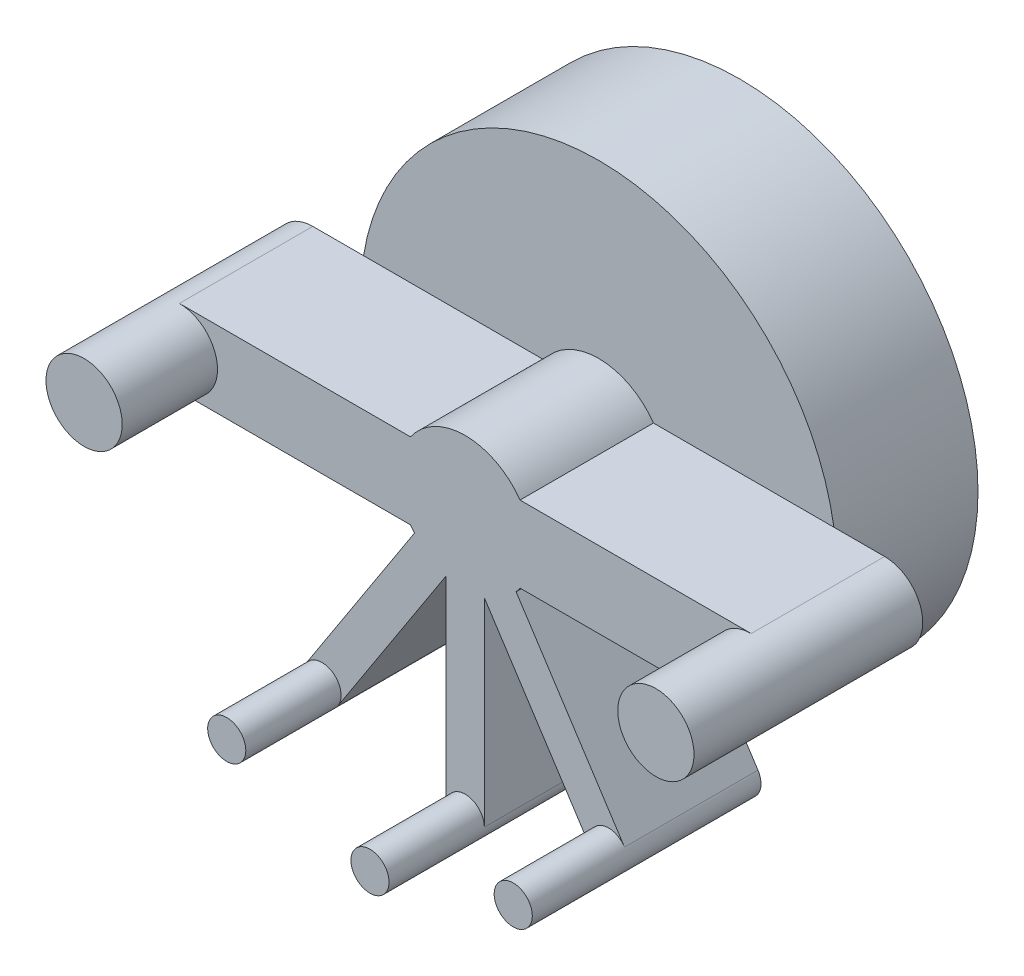
ISO-10303-21;
HEADER;
FILE_DESCRIPTION(('STEP AP214'),'2;1');
FILE_NAME('part.step','',(''),(''),'','','');
FILE_SCHEMA(('AUTOMOTIVE_DESIGN { 1 0 10303 214 1 1 1 1 }'));
ENDSEC;
DATA;
#1=APPLICATION_CONTEXT('core data for automotive mechanical design processes');
#2=APPLICATION_PROTOCOL_DEFINITION('international standard','automotive_design',2000,#1);
#3=PRODUCT_CONTEXT('',#1,'mechanical');
#4=PRODUCT('Part','Part','',(#3));
#5=PRODUCT_RELATED_PRODUCT_CATEGORY('part','',(#4));
#6=PRODUCT_DEFINITION_FORMATION('','',#4);
#7=PRODUCT_DEFINITION_CONTEXT('part definition',#1,'design');
#8=PRODUCT_DEFINITION('design','',#6,#7);
#9=PRODUCT_DEFINITION_SHAPE('','',#8);
#10=(LENGTH_UNIT() NAMED_UNIT(*) SI_UNIT(.MILLI.,.METRE.));
#11=(NAMED_UNIT(*) PLANE_ANGLE_UNIT() SI_UNIT($,.RADIAN.));
#12=(NAMED_UNIT(*) SI_UNIT($,.STERADIAN.) SOLID_ANGLE_UNIT());
#13=UNCERTAINTY_MEASURE_WITH_UNIT(LENGTH_MEASURE(1.E-05),#10,'distance_accuracy_value','');
#14=(GEOMETRIC_REPRESENTATION_CONTEXT(3) GLOBAL_UNCERTAINTY_ASSIGNED_CONTEXT((#13)) GLOBAL_UNIT_ASSIGNED_CONTEXT((#10,
#11,#12)) REPRESENTATION_CONTEXT('',''));
#15=CARTESIAN_POINT('',(0.,0.,0.));
#16=DIRECTION('',(0.,0.,1.));
#17=DIRECTION('',(1.,0.,0.));
#18=AXIS2_PLACEMENT_3D('',#15,#16,#17);
#19=CARTESIAN_POINT('',(0.,0.,3.5));
#20=DIRECTION('',(0.,0.,1.));
#21=DIRECTION('',(1.,0.,0.));
#22=AXIS2_PLACEMENT_3D('',#19,#20,#21);
#23=PLANE('',#22);
#24=DIRECTION('',(1.,0.,0.));
#25=VECTOR('',#24,1.);
#26=CARTESIAN_POINT('',(0.,-0.999999999999999,3.5));
#27=LINE('',#26,#25);
#28=CARTESIAN_POINT('',(1.43614066163451,-0.999999999999999,3.5));
#29=VERTEX_POINT('',#28);
#30=CARTESIAN_POINT('',(7.5,-0.999999999999999,3.5));
#31=VERTEX_POINT('',#30);
#32=EDGE_CURVE('E314',#29,#31,#27,.T.);
#33=ORIENTED_EDGE('',*,*,#32,.T.);
#34=CARTESIAN_POINT('',(7.5,0.,3.5));
#35=DIRECTION('',(0.,0.,1.));
#36=DIRECTION('',(1.,0.,0.));
#37=AXIS2_PLACEMENT_3D('',#34,#35,#36);
#38=CIRCLE('',#37,1.);
#39=CARTESIAN_POINT('',(7.5,1.,3.5));
#40=VERTEX_POINT('',#39);
#41=EDGE_CURVE('E399',#40,#31,#38,.T.);
#42=ORIENTED_EDGE('',*,*,#41,.F.);
#43=DIRECTION('',(-1.,0.,0.));
#44=VECTOR('',#43,1.);
#45=CARTESIAN_POINT('',(0.,1.,3.5));
#46=LINE('',#45,#44);
#47=CARTESIAN_POINT('',(1.43614066163451,1.,3.5));
#48=VERTEX_POINT('',#47);
#49=EDGE_CURVE('E316',#40,#48,#46,.T.);
#50=ORIENTED_EDGE('',*,*,#49,.T.);
#51=CARTESIAN_POINT('',(0.,0.,3.5));
#52=DIRECTION('',(0.,0.,1.));
#53=DIRECTION('',(1.,0.,0.));
#54=AXIS2_PLACEMENT_3D('',#51,#52,#53);
#55=CIRCLE('',#54,1.75);
#56=CARTESIAN_POINT('',(-1.43614066163451,1.,3.5));
#57=VERTEX_POINT('',#56);
#58=EDGE_CURVE('E254',#48,#57,#55,.T.);
#59=ORIENTED_EDGE('',*,*,#58,.T.);
#60=DIRECTION('',(-1.,0.,0.));
#61=VECTOR('',#60,1.);
#62=CARTESIAN_POINT('',(0.,1.,3.5));
#63=LINE('',#62,#61);
#64=CARTESIAN_POINT('',(-7.5,1.,3.5));
#65=VERTEX_POINT('',#64);
#66=EDGE_CURVE('E290',#57,#65,#63,.T.);
#67=ORIENTED_EDGE('',*,*,#66,.T.);
#68=CARTESIAN_POINT('',(-7.5,0.,3.5));
#69=DIRECTION('',(0.,0.,1.));
#70=DIRECTION('',(1.,0.,0.));
#71=AXIS2_PLACEMENT_3D('',#68,#69,#70);
#72=CIRCLE('',#71,1.);
#73=CARTESIAN_POINT('',(-7.5,-1.,3.5));
#74=VERTEX_POINT('',#73);
#75=EDGE_CURVE('E12',#74,#65,#72,.T.);
#76=ORIENTED_EDGE('',*,*,#75,.F.);
#77=DIRECTION('',(1.,0.,0.));
#78=VECTOR('',#77,1.);
#79=CARTESIAN_POINT('',(0.,-0.999999999999999,3.5));
#80=LINE('',#79,#78);
#81=CARTESIAN_POINT('',(-1.43614066163451,-0.999999999999999,3.5));
#82=VERTEX_POINT('',#81);
#83=EDGE_CURVE('E293',#74,#82,#80,.T.);
#84=ORIENTED_EDGE('',*,*,#83,.T.);
#85=CARTESIAN_POINT('',(-1.33272271309283,-1.13417378298323,3.5));
#86=VERTEX_POINT('',#85);
#87=EDGE_CURVE('E255',#82,#86,#55,.T.);
#88=ORIENTED_EDGE('',*,*,#87,.T.);
#89=DIRECTION('',(0.544639035015028,0.838670567945423,0.));
#90=VECTOR('',#89,1.);
#91=CARTESIAN_POINT('',(-0.419335283972712,0.272319517507514,3.5));
#92=LINE('',#91,#90);
#93=CARTESIAN_POINT('',(-4.17734462557641,-5.51450740131591,3.5));
#94=VERTEX_POINT('',#93);
#95=EDGE_CURVE('E222',#94,#86,#92,.T.);
#96=ORIENTED_EDGE('',*,*,#95,.F.);
#97=CARTESIAN_POINT('',(-3.75800934160369,-5.78682691882342,3.5));
#98=DIRECTION('',(0.,0.,1.));
#99=DIRECTION('',(1.,0.,0.));
#100=AXIS2_PLACEMENT_3D('',#97,#98,#99);
#101=CIRCLE('',#100,0.500000000000002);
#102=CARTESIAN_POINT('',(-3.33867405763098,-6.05914643633094,3.5));
#103=VERTEX_POINT('',#102);
#104=EDGE_CURVE('E406',#103,#94,#101,.T.);
#105=ORIENTED_EDGE('',*,*,#104,.F.);
#106=DIRECTION('',(0.544639035015028,0.838670567945424,0.));
#107=VECTOR('',#106,1.);
#108=CARTESIAN_POINT('',(0.41933528397271,-0.272319517507513,3.5));
#109=LINE('',#108,#107);
#110=CARTESIAN_POINT('',(-0.499999999999999,-1.68797171129562,3.5));
#111=VERTEX_POINT('',#110);
#112=EDGE_CURVE('E225',#103,#111,#109,.T.);
#113=ORIENTED_EDGE('',*,*,#112,.T.);
#114=DIRECTION('',(0.,1.,0.));
#115=VECTOR('',#114,1.);
#116=CARTESIAN_POINT('',(-0.499999999999999,0.,3.5));
#117=LINE('',#116,#115);
#118=CARTESIAN_POINT('',(-0.499999999999999,-6.9,3.5));
#119=VERTEX_POINT('',#118);
#120=EDGE_CURVE('E341',#119,#111,#117,.T.);
#121=ORIENTED_EDGE('',*,*,#120,.F.);
#122=CARTESIAN_POINT('',(0.,-6.9,3.5));
#123=DIRECTION('',(0.,0.,1.));
#124=DIRECTION('',(1.,0.,0.));
#125=AXIS2_PLACEMENT_3D('',#122,#123,#124);
#126=CIRCLE('',#125,0.5);
#127=CARTESIAN_POINT('',(0.500000000000001,-6.9,3.5));
#128=VERTEX_POINT('',#127);
#129=EDGE_CURVE('E396',#128,#119,#126,.T.);
#130=ORIENTED_EDGE('',*,*,#129,.F.);
#131=DIRECTION('',(0.,1.,0.));
#132=VECTOR('',#131,1.);
#133=CARTESIAN_POINT('',(0.500000000000001,0.,3.5));
#134=LINE('',#133,#132);
#135=CARTESIAN_POINT('',(0.500000000000001,-1.68797171129562,3.5));
#136=VERTEX_POINT('',#135);
#137=EDGE_CURVE('E344',#128,#136,#134,.T.);
#138=ORIENTED_EDGE('',*,*,#137,.T.);
#139=DIRECTION('',(-0.544639035015028,0.838670567945423,0.));
#140=VECTOR('',#139,1.);
#141=CARTESIAN_POINT('',(-0.419335283972711,-0.272319517507513,3.5));
#142=LINE('',#141,#140);
#143=CARTESIAN_POINT('',(3.33867405763098,-6.05914643633094,3.5));
#144=VERTEX_POINT('',#143);
#145=EDGE_CURVE('E346',#144,#136,#142,.T.);
#146=ORIENTED_EDGE('',*,*,#145,.F.);
#147=CARTESIAN_POINT('',(3.7580093416037,-5.78682691882342,3.5));
#148=DIRECTION('',(0.,0.,1.));
#149=DIRECTION('',(1.,0.,0.));
#150=AXIS2_PLACEMENT_3D('',#147,#148,#149);
#151=CIRCLE('',#150,0.500000000000002);
#152=CARTESIAN_POINT('',(4.17734462557641,-5.51450740131591,3.5));
#153=VERTEX_POINT('',#152);
#154=EDGE_CURVE('E390',#153,#144,#151,.T.);
#155=ORIENTED_EDGE('',*,*,#154,.F.);
#156=DIRECTION('',(-0.544639035015029,0.838670567945423,0.));
#157=VECTOR('',#156,1.);
#158=CARTESIAN_POINT('',(0.419335283972708,0.272319517507512,3.5));
#159=LINE('',#158,#157);
#160=CARTESIAN_POINT('',(1.33272271309283,-1.13417378298323,3.5));
#161=VERTEX_POINT('',#160);
#162=EDGE_CURVE('E215',#153,#161,#159,.T.);
#163=ORIENTED_EDGE('',*,*,#162,.T.);
#164=EDGE_CURVE('E251',#161,#29,#55,.T.);
#165=ORIENTED_EDGE('',*,*,#164,.T.);
#166=EDGE_LOOP('',(#33,#42,#50,#59,#67,#76,#84,#88,#96,#105,#113,#121,#130,#138,#146,#155,#163,#165));
#167=FACE_BOUND('',#166,.T.);
#168=ADVANCED_FACE('F96',(#167),#23,.T.);
#169=CARTESIAN_POINT('',(0.,0.,0.));
#170=DIRECTION('',(0.,0.,1.));
#171=DIRECTION('',(1.,0.,0.));
#172=AXIS2_PLACEMENT_3D('',#169,#170,#171);
#173=PLANE('',#172);
#174=DIRECTION('',(-1.,0.,0.));
#175=VECTOR('',#174,1.);
#176=CARTESIAN_POINT('',(0.,1.,0.));
#177=LINE('',#176,#175);
#178=CARTESIAN_POINT('',(-6.16948133962653,1.,0.));
#179=VERTEX_POINT('',#178);
#180=CARTESIAN_POINT('',(-7.5,1.,0.));
#181=VERTEX_POINT('',#180);
#182=EDGE_CURVE('E300',#179,#181,#177,.T.);
#183=ORIENTED_EDGE('',*,*,#182,.F.);
#184=CARTESIAN_POINT('',(0.,0.,0.));
#185=DIRECTION('',(0.,0.,1.));
#186=DIRECTION('',(1.,0.,0.));
#187=AXIS2_PLACEMENT_3D('',#184,#185,#186);
#188=CIRCLE('',#187,6.25);
#189=CARTESIAN_POINT('',(-6.16948133962653,-1.,0.));
#190=VERTEX_POINT('',#189);
#191=EDGE_CURVE('E105',#179,#190,#188,.T.);
#192=ORIENTED_EDGE('',*,*,#191,.T.);
#193=DIRECTION('',(1.,0.,0.));
#194=VECTOR('',#193,1.);
#195=CARTESIAN_POINT('',(0.,-0.999999999999999,0.));
#196=LINE('',#195,#194);
#197=CARTESIAN_POINT('',(-7.5,-1.,0.));
#198=VERTEX_POINT('',#197);
#199=EDGE_CURVE('E294',#198,#190,#196,.T.);
#200=ORIENTED_EDGE('',*,*,#199,.F.);
#201=CARTESIAN_POINT('',(-7.5,0.,0.));
#202=DIRECTION('',(0.,0.,1.));
#203=DIRECTION('',(1.,0.,0.));
#204=AXIS2_PLACEMENT_3D('',#201,#202,#203);
#205=CIRCLE('',#204,1.);
#206=EDGE_CURVE('E299',#181,#198,#205,.T.);
#207=ORIENTED_EDGE('',*,*,#206,.F.);
#208=EDGE_LOOP('',(#183,#192,#200,#207));
#209=FACE_BOUND('',#208,.T.);
#210=ADVANCED_FACE('F445',(#209),#173,.F.);
#211=DIRECTION('',(0.544639035015028,0.838670567945423,0.));
#212=VECTOR('',#211,1.);
#213=CARTESIAN_POINT('',(-0.419335283972712,0.272319517507514,0.));
#214=LINE('',#213,#212);
#215=CARTESIAN_POINT('',(-4.17734462557641,-5.51450740131591,0.));
#216=VERTEX_POINT('',#215);
#217=CARTESIAN_POINT('',(-3.81241898767209,-4.95257119710937,0.));
#218=VERTEX_POINT('',#217);
#219=EDGE_CURVE('E260',#216,#218,#214,.T.);
#220=ORIENTED_EDGE('',*,*,#219,.T.);
#221=CARTESIAN_POINT('',(-2.97374841972667,-5.4972102321244,0.));
#222=VERTEX_POINT('',#221);
#223=EDGE_CURVE('E594',#218,#222,#188,.T.);
#224=ORIENTED_EDGE('',*,*,#223,.T.);
#225=DIRECTION('',(0.544639035015028,0.838670567945424,0.));
#226=VECTOR('',#225,1.);
#227=CARTESIAN_POINT('',(0.41933528397271,-0.272319517507513,0.));
#228=LINE('',#227,#226);
#229=CARTESIAN_POINT('',(-3.33867405763098,-6.05914643633094,0.));
#230=VERTEX_POINT('',#229);
#231=EDGE_CURVE('E354',#230,#222,#228,.T.);
#232=ORIENTED_EDGE('',*,*,#231,.F.);
#233=CARTESIAN_POINT('',(-3.75800934160369,-5.78682691882342,0.));
#234=DIRECTION('',(0.,0.,1.));
#235=DIRECTION('',(1.,0.,0.));
#236=AXIS2_PLACEMENT_3D('',#233,#234,#235);
#237=CIRCLE('',#236,0.500000000000002);
#238=EDGE_CURVE('E351',#216,#230,#237,.T.);
#239=ORIENTED_EDGE('',*,*,#238,.F.);
#240=EDGE_LOOP('',(#220,#224,#232,#239));
#241=FACE_BOUND('',#240,.T.);
#242=ADVANCED_FACE('F450',(#241),#173,.F.);
#243=DIRECTION('',(0.,1.,0.));
#244=VECTOR('',#243,1.);
#245=CARTESIAN_POINT('',(-0.499999999999999,0.,0.));
#246=LINE('',#245,#244);
#247=CARTESIAN_POINT('',(-0.499999999999999,-6.9,0.));
#248=VERTEX_POINT('',#247);
#249=CARTESIAN_POINT('',(-0.499999999999999,-6.22996789718856,0.));
#250=VERTEX_POINT('',#249);
#251=EDGE_CURVE('E358',#248,#250,#246,.T.);
#252=ORIENTED_EDGE('',*,*,#251,.T.);
#253=CARTESIAN_POINT('',(0.500000000000001,-6.22996789718856,0.));
#254=VERTEX_POINT('',#253);
#255=EDGE_CURVE('E597',#250,#254,#188,.T.);
#256=ORIENTED_EDGE('',*,*,#255,.T.);
#257=DIRECTION('',(0.,1.,0.));
#258=VECTOR('',#257,1.);
#259=CARTESIAN_POINT('',(0.500000000000001,0.,0.));
#260=LINE('',#259,#258);
#261=CARTESIAN_POINT('',(0.500000000000001,-6.9,0.));
#262=VERTEX_POINT('',#261);
#263=EDGE_CURVE('E364',#262,#254,#260,.T.);
#264=ORIENTED_EDGE('',*,*,#263,.F.);
#265=CARTESIAN_POINT('',(0.,-6.9,0.));
#266=DIRECTION('',(0.,0.,1.));
#267=DIRECTION('',(1.,0.,0.));
#268=AXIS2_PLACEMENT_3D('',#265,#266,#267);
#269=CIRCLE('',#268,0.5);
#270=EDGE_CURVE('E361',#248,#262,#269,.T.);
#271=ORIENTED_EDGE('',*,*,#270,.F.);
#272=EDGE_LOOP('',(#252,#256,#264,#271));
#273=FACE_BOUND('',#272,.T.);
#274=ADVANCED_FACE('F602',(#273),#173,.F.);
#275=DIRECTION('',(-0.544639035015028,0.838670567945423,0.));
#276=VECTOR('',#275,1.);
#277=CARTESIAN_POINT('',(-0.419335283972711,-0.272319517507513,0.));
#278=LINE('',#277,#276);
#279=CARTESIAN_POINT('',(3.33867405763098,-6.05914643633094,0.));
#280=VERTEX_POINT('',#279);
#281=CARTESIAN_POINT('',(2.97374841972667,-5.4972102321244,0.));
#282=VERTEX_POINT('',#281);
#283=EDGE_CURVE('E205',#280,#282,#278,.T.);
#284=ORIENTED_EDGE('',*,*,#283,.T.);
#285=CARTESIAN_POINT('',(3.81241898767209,-4.95257119710937,0.));
#286=VERTEX_POINT('',#285);
#287=EDGE_CURVE('E221',#282,#286,#188,.T.);
#288=ORIENTED_EDGE('',*,*,#287,.T.);
#289=DIRECTION('',(-0.544639035015029,0.838670567945423,0.));
#290=VECTOR('',#289,1.);
#291=CARTESIAN_POINT('',(0.419335283972708,0.272319517507512,0.));
#292=LINE('',#291,#290);
#293=CARTESIAN_POINT('',(4.17734462557641,-5.51450740131591,0.));
#294=VERTEX_POINT('',#293);
#295=EDGE_CURVE('E213',#294,#286,#292,.T.);
#296=ORIENTED_EDGE('',*,*,#295,.F.);
#297=CARTESIAN_POINT('',(3.7580093416037,-5.78682691882342,0.));
#298=DIRECTION('',(0.,0.,1.));
#299=DIRECTION('',(1.,0.,0.));
#300=AXIS2_PLACEMENT_3D('',#297,#298,#299);
#301=CIRCLE('',#300,0.500000000000002);
#302=EDGE_CURVE('E191',#280,#294,#301,.T.);
#303=ORIENTED_EDGE('',*,*,#302,.F.);
#304=EDGE_LOOP('',(#284,#288,#296,#303));
#305=FACE_BOUND('',#304,.T.);
#306=ADVANCED_FACE('F219',(#305),#173,.F.);
#307=CARTESIAN_POINT('',(-7.5,0.,3.5));
#308=DIRECTION('',(0.,0.,-1.));
#309=DIRECTION('',(-1.,0.,0.));
#310=AXIS2_PLACEMENT_3D('',#307,#308,#309);
#311=CYLINDRICAL_SURFACE('',#310,1.);
#312=ORIENTED_EDGE('',*,*,#206,.T.);
#313=DIRECTION('',(0.,0.,-1.));
#314=VECTOR('',#313,1.);
#315=CARTESIAN_POINT('',(-7.5,-1.,3.5));
#316=LINE('',#315,#314);
#317=EDGE_CURVE('E308',#74,#198,#316,.T.);
#318=ORIENTED_EDGE('',*,*,#317,.F.);
#319=ORIENTED_EDGE('',*,*,#75,.T.);
#320=DIRECTION('',(0.,0.,-1.));
#321=VECTOR('',#320,1.);
#322=CARTESIAN_POINT('',(-7.5,1.,3.5));
#323=LINE('',#322,#321);
#324=EDGE_CURVE('E311',#65,#181,#323,.T.);
#325=ORIENTED_EDGE('',*,*,#324,.T.);
#326=EDGE_LOOP('',(#312,#318,#319,#325));
#327=FACE_BOUND('',#326,.T.);
#328=CARTESIAN_POINT('',(-7.5,0.,6.));
#329=DIRECTION('',(0.,0.,1.));
#330=DIRECTION('',(1.,0.,0.));
#331=AXIS2_PLACEMENT_3D('',#328,#329,#330);
#332=CIRCLE('',#331,1.);
#333=CARTESIAN_POINT('',(-6.5,0.,6.));
#334=VERTEX_POINT('',#333);
#335=EDGE_CURVE('E412',#334,#334,#332,.T.);
#336=ORIENTED_EDGE('',*,*,#335,.F.);
#337=EDGE_LOOP('',(#336));
#338=FACE_BOUND('',#337,.T.);
#339=ADVANCED_FACE('F465',(#327,#338),#311,.T.);
#340=CARTESIAN_POINT('',(0.,-0.999999999999999,3.5));
#341=DIRECTION('',(0.,1.,0.));
#342=DIRECTION('',(-1.,0.,0.));
#343=AXIS2_PLACEMENT_3D('',#340,#341,#342);
#344=PLANE('',#343);
#345=ORIENTED_EDGE('',*,*,#199,.T.);
#346=CARTESIAN_POINT('',(-1.43614066163451,-0.999999999999999,0.));
#347=VERTEX_POINT('',#346);
#348=EDGE_CURVE('E302',#190,#347,#196,.T.);
#349=ORIENTED_EDGE('',*,*,#348,.T.);
#350=DIRECTION('',(0.,0.,-1.));
#351=VECTOR('',#350,1.);
#352=CARTESIAN_POINT('',(-1.43614066163451,-0.999999999999999,3.5));
#353=LINE('',#352,#351);
#354=EDGE_CURVE('E306',#82,#347,#353,.T.);
#355=ORIENTED_EDGE('',*,*,#354,.F.);
#356=ORIENTED_EDGE('',*,*,#83,.F.);
#357=ORIENTED_EDGE('',*,*,#317,.T.);
#358=EDGE_LOOP('',(#345,#349,#355,#356,#357));
#359=FACE_BOUND('',#358,.T.);
#360=ADVANCED_FACE('F462',(#359),#344,.F.);
#361=CARTESIAN_POINT('',(0.,1.,3.5));
#362=DIRECTION('',(0.,-1.,0.));
#363=DIRECTION('',(1.,0.,0.));
#364=AXIS2_PLACEMENT_3D('',#361,#362,#363);
#365=PLANE('',#364);
#366=CARTESIAN_POINT('',(-1.43614066163451,1.,0.));
#367=VERTEX_POINT('',#366);
#368=EDGE_CURVE('E296',#367,#179,#177,.T.);
#369=ORIENTED_EDGE('',*,*,#368,.T.);
#370=ORIENTED_EDGE('',*,*,#182,.T.);
#371=ORIENTED_EDGE('',*,*,#324,.F.);
#372=ORIENTED_EDGE('',*,*,#66,.F.);
#373=DIRECTION('',(0.,0.,-1.));
#374=VECTOR('',#373,1.);
#375=CARTESIAN_POINT('',(-1.43614066163451,1.,3.5));
#376=LINE('',#375,#374);
#377=EDGE_CURVE('E122',#57,#367,#376,.T.);
#378=ORIENTED_EDGE('',*,*,#377,.T.);
#379=EDGE_LOOP('',(#369,#370,#371,#372,#378));
#380=FACE_BOUND('',#379,.T.);
#381=ADVANCED_FACE('F459',(#380),#365,.F.);
#382=DIRECTION('',(1.,0.,0.));
#383=VECTOR('',#382,1.);
#384=CARTESIAN_POINT('',(0.,-0.999999999999999,0.));
#385=LINE('',#384,#383);
#386=CARTESIAN_POINT('',(6.16948133962653,-0.999999999999999,0.));
#387=VERTEX_POINT('',#386);
#388=CARTESIAN_POINT('',(7.5,-0.999999999999999,0.));
#389=VERTEX_POINT('',#388);
#390=EDGE_CURVE('E250',#387,#389,#385,.T.);
#391=ORIENTED_EDGE('',*,*,#390,.F.);
#392=CARTESIAN_POINT('',(6.16948133962653,1.,0.));
#393=VERTEX_POINT('',#392);
#394=EDGE_CURVE('E285',#387,#393,#188,.T.);
#395=ORIENTED_EDGE('',*,*,#394,.T.);
#396=DIRECTION('',(-1.,0.,0.));
#397=VECTOR('',#396,1.);
#398=CARTESIAN_POINT('',(0.,1.,0.));
#399=LINE('',#398,#397);
#400=CARTESIAN_POINT('',(7.5,1.,0.));
#401=VERTEX_POINT('',#400);
#402=EDGE_CURVE('E317',#401,#393,#399,.T.);
#403=ORIENTED_EDGE('',*,*,#402,.F.);
#404=CARTESIAN_POINT('',(7.5,0.,0.));
#405=DIRECTION('',(0.,0.,1.));
#406=DIRECTION('',(1.,0.,0.));
#407=AXIS2_PLACEMENT_3D('',#404,#405,#406);
#408=CIRCLE('',#407,1.);
#409=EDGE_CURVE('E324',#389,#401,#408,.T.);
#410=ORIENTED_EDGE('',*,*,#409,.F.);
#411=EDGE_LOOP('',(#391,#395,#403,#410));
#412=FACE_BOUND('',#411,.T.);
#413=ADVANCED_FACE('F453',(#412),#173,.F.);
#414=CARTESIAN_POINT('',(0.,-0.999999999999999,3.5));
#415=DIRECTION('',(0.,1.,0.));
#416=DIRECTION('',(-1.,0.,0.));
#417=AXIS2_PLACEMENT_3D('',#414,#415,#416);
#418=PLANE('',#417);
#419=CARTESIAN_POINT('',(1.43614066163451,-0.999999999999999,0.));
#420=VERTEX_POINT('',#419);
#421=EDGE_CURVE('E321',#420,#387,#385,.T.);
#422=ORIENTED_EDGE('',*,*,#421,.T.);
#423=ORIENTED_EDGE('',*,*,#390,.T.);
#424=DIRECTION('',(0.,0.,-1.));
#425=VECTOR('',#424,1.);
#426=CARTESIAN_POINT('',(7.5,-0.999999999999999,3.5));
#427=LINE('',#426,#425);
#428=EDGE_CURVE('E334',#31,#389,#427,.T.);
#429=ORIENTED_EDGE('',*,*,#428,.F.);
#430=ORIENTED_EDGE('',*,*,#32,.F.);
#431=DIRECTION('',(0.,0.,-1.));
#432=VECTOR('',#431,1.);
#433=CARTESIAN_POINT('',(1.43614066163451,-0.999999999999999,3.5));
#434=LINE('',#433,#432);
#435=EDGE_CURVE('E337',#29,#420,#434,.T.);
#436=ORIENTED_EDGE('',*,*,#435,.T.);
#437=EDGE_LOOP('',(#422,#423,#429,#430,#436));
#438=FACE_BOUND('',#437,.T.);
#439=ADVANCED_FACE('F458',(#438),#418,.F.);
#440=CARTESIAN_POINT('',(7.5,0.,3.5));
#441=DIRECTION('',(0.,0.,-1.));
#442=DIRECTION('',(-1.,0.,0.));
#443=AXIS2_PLACEMENT_3D('',#440,#441,#442);
#444=CYLINDRICAL_SURFACE('',#443,1.);
#445=ORIENTED_EDGE('',*,*,#409,.T.);
#446=DIRECTION('',(0.,0.,-1.));
#447=VECTOR('',#446,1.);
#448=CARTESIAN_POINT('',(7.5,1.,3.5));
#449=LINE('',#448,#447);
#450=EDGE_CURVE('E331',#40,#401,#449,.T.);
#451=ORIENTED_EDGE('',*,*,#450,.F.);
#452=ORIENTED_EDGE('',*,*,#41,.T.);
#453=ORIENTED_EDGE('',*,*,#428,.T.);
#454=EDGE_LOOP('',(#445,#451,#452,#453));
#455=FACE_BOUND('',#454,.T.);
#456=CARTESIAN_POINT('',(7.5,0.,6.));
#457=DIRECTION('',(0.,0.,1.));
#458=DIRECTION('',(1.,0.,0.));
#459=AXIS2_PLACEMENT_3D('',#456,#457,#458);
#460=CIRCLE('',#459,1.);
#461=CARTESIAN_POINT('',(8.5,0.,6.));
#462=VERTEX_POINT('',#461);
#463=EDGE_CURVE('E393',#462,#462,#460,.T.);
#464=ORIENTED_EDGE('',*,*,#463,.F.);
#465=EDGE_LOOP('',(#464));
#466=FACE_BOUND('',#465,.T.);
#467=ADVANCED_FACE('F478',(#455,#466),#444,.T.);
#468=CARTESIAN_POINT('',(-3.75800934160369,-5.78682691882342,3.5));
#469=DIRECTION('',(0.,0.,-1.));
#470=DIRECTION('',(-1.,0.,0.));
#471=AXIS2_PLACEMENT_3D('',#468,#469,#470);
#472=CYLINDRICAL_SURFACE('',#471,0.500000000000002);
#473=ORIENTED_EDGE('',*,*,#238,.T.);
#474=DIRECTION('',(0.,0.,-1.));
#475=VECTOR('',#474,1.);
#476=CARTESIAN_POINT('',(-3.33867405763098,-6.05914643633094,3.5));
#477=LINE('',#476,#475);
#478=EDGE_CURVE('E243',#103,#230,#477,.T.);
#479=ORIENTED_EDGE('',*,*,#478,.F.);
#480=ORIENTED_EDGE('',*,*,#104,.T.);
#481=DIRECTION('',(0.,0.,-1.));
#482=VECTOR('',#481,1.);
#483=CARTESIAN_POINT('',(-4.17734462557641,-5.51450740131591,3.5));
#484=LINE('',#483,#482);
#485=EDGE_CURVE('E246',#94,#216,#484,.T.);
#486=ORIENTED_EDGE('',*,*,#485,.T.);
#487=EDGE_LOOP('',(#473,#479,#480,#486));
#488=FACE_BOUND('',#487,.T.);
#489=CARTESIAN_POINT('',(-3.75800934160369,-5.78682691882342,6.));
#490=DIRECTION('',(0.,0.,1.));
#491=DIRECTION('',(1.,0.,0.));
#492=AXIS2_PLACEMENT_3D('',#489,#490,#491);
#493=CIRCLE('',#492,0.500000000000002);
#494=CARTESIAN_POINT('',(-3.25800934160369,-5.78682691882342,6.));
#495=VERTEX_POINT('',#494);
#496=EDGE_CURVE('E409',#495,#495,#493,.T.);
#497=ORIENTED_EDGE('',*,*,#496,.F.);
#498=EDGE_LOOP('',(#497));
#499=FACE_BOUND('',#498,.T.);
#500=ADVANCED_FACE('F481',(#488,#499),#472,.T.);
#501=CARTESIAN_POINT('',(0.41933528397271,-0.272319517507513,3.5));
#502=DIRECTION('',(-0.838670567945424,0.544639035015028,0.));
#503=DIRECTION('',(-0.544639035015028,-0.838670567945424,0.));
#504=AXIS2_PLACEMENT_3D('',#501,#502,#503);
#505=PLANE('',#504);
#506=ORIENTED_EDGE('',*,*,#231,.T.);
#507=CARTESIAN_POINT('',(-0.499999999999999,-1.68797171129562,0.));
#508=VERTEX_POINT('',#507);
#509=EDGE_CURVE('E353',#222,#508,#228,.T.);
#510=ORIENTED_EDGE('',*,*,#509,.T.);
#511=DIRECTION('',(0.,0.,-1.));
#512=VECTOR('',#511,1.);
#513=CARTESIAN_POINT('',(-0.499999999999999,-1.68797171129562,3.5));
#514=LINE('',#513,#512);
#515=EDGE_CURVE('E240',#111,#508,#514,.T.);
#516=ORIENTED_EDGE('',*,*,#515,.F.);
#517=ORIENTED_EDGE('',*,*,#112,.F.);
#518=ORIENTED_EDGE('',*,*,#478,.T.);
#519=EDGE_LOOP('',(#506,#510,#516,#517,#518));
#520=FACE_BOUND('',#519,.T.);
#521=ADVANCED_FACE('F501',(#520),#505,.F.);
#522=CARTESIAN_POINT('',(-0.499999999999999,0.,3.5));
#523=DIRECTION('',(-1.,0.,0.));
#524=DIRECTION('',(0.,0.,1.));
#525=AXIS2_PLACEMENT_3D('',#522,#523,#524);
#526=PLANE('',#525);
#527=ORIENTED_EDGE('',*,*,#251,.F.);
#528=DIRECTION('',(0.,0.,-1.));
#529=VECTOR('',#528,1.);
#530=CARTESIAN_POINT('',(-0.499999999999999,-6.9,3.5));
#531=LINE('',#530,#529);
#532=EDGE_CURVE('E238',#119,#248,#531,.T.);
#533=ORIENTED_EDGE('',*,*,#532,.F.);
#534=ORIENTED_EDGE('',*,*,#120,.T.);
#535=ORIENTED_EDGE('',*,*,#515,.T.);
#536=EDGE_CURVE('E357',#250,#508,#246,.T.);
#537=ORIENTED_EDGE('',*,*,#536,.F.);
#538=EDGE_LOOP('',(#527,#533,#534,#535,#537));
#539=FACE_BOUND('',#538,.T.);
#540=ADVANCED_FACE('F497',(#539),#526,.T.);
#541=CARTESIAN_POINT('',(0.,-6.9,3.5));
#542=DIRECTION('',(0.,0.,-1.));
#543=DIRECTION('',(-1.,0.,0.));
#544=AXIS2_PLACEMENT_3D('',#541,#542,#543);
#545=CYLINDRICAL_SURFACE('',#544,0.5);
#546=ORIENTED_EDGE('',*,*,#270,.T.);
#547=DIRECTION('',(0.,0.,-1.));
#548=VECTOR('',#547,1.);
#549=CARTESIAN_POINT('',(0.500000000000001,-6.9,3.5));
#550=LINE('',#549,#548);
#551=EDGE_CURVE('E235',#128,#262,#550,.T.);
#552=ORIENTED_EDGE('',*,*,#551,.F.);
#553=ORIENTED_EDGE('',*,*,#129,.T.);
#554=ORIENTED_EDGE('',*,*,#532,.T.);
#555=EDGE_LOOP('',(#546,#552,#553,#554));
#556=FACE_BOUND('',#555,.T.);
#557=CARTESIAN_POINT('',(0.,-6.9,6.));
#558=DIRECTION('',(0.,0.,1.));
#559=DIRECTION('',(1.,0.,0.));
#560=AXIS2_PLACEMENT_3D('',#557,#558,#559);
#561=CIRCLE('',#560,0.5);
#562=CARTESIAN_POINT('',(0.500000000000001,-6.9,6.));
#563=VERTEX_POINT('',#562);
#564=EDGE_CURVE('E403',#563,#563,#561,.T.);
#565=ORIENTED_EDGE('',*,*,#564,.F.);
#566=EDGE_LOOP('',(#565));
#567=FACE_BOUND('',#566,.T.);
#568=ADVANCED_FACE('F494',(#556,#567),#545,.T.);
#569=CARTESIAN_POINT('',(0.500000000000001,0.,3.5));
#570=DIRECTION('',(-1.,0.,0.));
#571=DIRECTION('',(0.,0.,1.));
#572=AXIS2_PLACEMENT_3D('',#569,#570,#571);
#573=PLANE('',#572);
#574=ORIENTED_EDGE('',*,*,#263,.T.);
#575=CARTESIAN_POINT('',(0.500000000000001,-1.68797171129562,0.));
#576=VERTEX_POINT('',#575);
#577=EDGE_CURVE('E363',#254,#576,#260,.T.);
#578=ORIENTED_EDGE('',*,*,#577,.T.);
#579=DIRECTION('',(0.,0.,-1.));
#580=VECTOR('',#579,1.);
#581=CARTESIAN_POINT('',(0.500000000000001,-1.68797171129562,3.5));
#582=LINE('',#581,#580);
#583=EDGE_CURVE('E232',#136,#576,#582,.T.);
#584=ORIENTED_EDGE('',*,*,#583,.F.);
#585=ORIENTED_EDGE('',*,*,#137,.F.);
#586=ORIENTED_EDGE('',*,*,#551,.T.);
#587=EDGE_LOOP('',(#574,#578,#584,#585,#586));
#588=FACE_BOUND('',#587,.T.);
#589=ADVANCED_FACE('F385',(#588),#573,.F.);
#590=CARTESIAN_POINT('',(-0.419335283972711,-0.272319517507513,3.5));
#591=DIRECTION('',(-0.838670567945423,-0.544639035015028,0.));
#592=DIRECTION('',(0.544639035015028,-0.838670567945424,0.));
#593=AXIS2_PLACEMENT_3D('',#590,#591,#592);
#594=PLANE('',#593);
#595=ORIENTED_EDGE('',*,*,#283,.F.);
#596=DIRECTION('',(0.,0.,-1.));
#597=VECTOR('',#596,1.);
#598=CARTESIAN_POINT('',(3.33867405763098,-6.05914643633094,3.5));
#599=LINE('',#598,#597);
#600=EDGE_CURVE('E199',#144,#280,#599,.T.);
#601=ORIENTED_EDGE('',*,*,#600,.F.);
#602=ORIENTED_EDGE('',*,*,#145,.T.);
#603=ORIENTED_EDGE('',*,*,#583,.T.);
#604=EDGE_CURVE('E366',#282,#576,#278,.T.);
#605=ORIENTED_EDGE('',*,*,#604,.F.);
#606=EDGE_LOOP('',(#595,#601,#602,#603,#605));
#607=FACE_BOUND('',#606,.T.);
#608=ADVANCED_FACE('F388',(#607),#594,.T.);
#609=CARTESIAN_POINT('',(3.7580093416037,-5.78682691882342,3.5));
#610=DIRECTION('',(0.,0.,-1.));
#611=DIRECTION('',(-1.,0.,0.));
#612=AXIS2_PLACEMENT_3D('',#609,#610,#611);
#613=CYLINDRICAL_SURFACE('',#612,0.500000000000002);
#614=ORIENTED_EDGE('',*,*,#302,.T.);
#615=DIRECTION('',(0.,0.,-1.));
#616=VECTOR('',#615,1.);
#617=CARTESIAN_POINT('',(4.17734462557641,-5.51450740131591,3.5));
#618=LINE('',#617,#616);
#619=EDGE_CURVE('E197',#153,#294,#618,.T.);
#620=ORIENTED_EDGE('',*,*,#619,.F.);
#621=ORIENTED_EDGE('',*,*,#154,.T.);
#622=ORIENTED_EDGE('',*,*,#600,.T.);
#623=EDGE_LOOP('',(#614,#620,#621,#622));
#624=FACE_BOUND('',#623,.T.);
#625=CARTESIAN_POINT('',(3.7580093416037,-5.78682691882342,6.));
#626=DIRECTION('',(0.,0.,1.));
#627=DIRECTION('',(1.,0.,0.));
#628=AXIS2_PLACEMENT_3D('',#625,#626,#627);
#629=CIRCLE('',#628,0.500000000000002);
#630=CARTESIAN_POINT('',(4.2580093416037,-5.78682691882342,6.));
#631=VERTEX_POINT('',#630);
#632=EDGE_CURVE('E392',#631,#631,#629,.T.);
#633=ORIENTED_EDGE('',*,*,#632,.F.);
#634=EDGE_LOOP('',(#633));
#635=FACE_BOUND('',#634,.T.);
#636=ADVANCED_FACE('F193',(#624,#635),#613,.T.);
#637=CARTESIAN_POINT('',(0.419335283972708,0.272319517507512,3.5));
#638=DIRECTION('',(-0.838670567945423,-0.544639035015029,0.));
#639=DIRECTION('',(0.544639035015029,-0.838670567945423,0.));
#640=AXIS2_PLACEMENT_3D('',#637,#638,#639);
#641=PLANE('',#640);
#642=ORIENTED_EDGE('',*,*,#295,.T.);
#643=CARTESIAN_POINT('',(1.33272271309283,-1.13417378298323,0.));
#644=VERTEX_POINT('',#643);
#645=EDGE_CURVE('E204',#286,#644,#292,.T.);
#646=ORIENTED_EDGE('',*,*,#645,.T.);
#647=DIRECTION('',(0.,0.,-1.));
#648=VECTOR('',#647,1.);
#649=CARTESIAN_POINT('',(1.33272271309283,-1.13417378298323,3.5));
#650=LINE('',#649,#648);
#651=EDGE_CURVE('E216',#161,#644,#650,.T.);
#652=ORIENTED_EDGE('',*,*,#651,.F.);
#653=ORIENTED_EDGE('',*,*,#162,.F.);
#654=ORIENTED_EDGE('',*,*,#619,.T.);
#655=EDGE_LOOP('',(#642,#646,#652,#653,#654));
#656=FACE_BOUND('',#655,.T.);
#657=ADVANCED_FACE('F210',(#656),#641,.F.);
#658=CARTESIAN_POINT('',(0.,1.,3.5));
#659=DIRECTION('',(0.,-1.,0.));
#660=DIRECTION('',(1.,0.,0.));
#661=AXIS2_PLACEMENT_3D('',#658,#659,#660);
#662=PLANE('',#661);
#663=ORIENTED_EDGE('',*,*,#402,.T.);
#664=CARTESIAN_POINT('',(1.43614066163451,1.,0.));
#665=VERTEX_POINT('',#664);
#666=EDGE_CURVE('E326',#393,#665,#399,.T.);
#667=ORIENTED_EDGE('',*,*,#666,.T.);
#668=DIRECTION('',(0.,0.,-1.));
#669=VECTOR('',#668,1.);
#670=CARTESIAN_POINT('',(1.43614066163451,1.,3.5));
#671=LINE('',#670,#669);
#672=EDGE_CURVE('E320',#48,#665,#671,.T.);
#673=ORIENTED_EDGE('',*,*,#672,.F.);
#674=ORIENTED_EDGE('',*,*,#49,.F.);
#675=ORIENTED_EDGE('',*,*,#450,.T.);
#676=EDGE_LOOP('',(#663,#667,#673,#674,#675));
#677=FACE_BOUND('',#676,.T.);
#678=ADVANCED_FACE('F473',(#677),#662,.F.);
#679=CARTESIAN_POINT('',(-0.419335283972712,0.272319517507514,3.5));
#680=DIRECTION('',(-0.838670567945423,0.544639035015028,0.));
#681=DIRECTION('',(-0.544639035015028,-0.838670567945423,0.));
#682=AXIS2_PLACEMENT_3D('',#679,#680,#681);
#683=PLANE('',#682);
#684=ORIENTED_EDGE('',*,*,#219,.F.);
#685=ORIENTED_EDGE('',*,*,#485,.F.);
#686=ORIENTED_EDGE('',*,*,#95,.T.);
#687=DIRECTION('',(0.,0.,-1.));
#688=VECTOR('',#687,1.);
#689=CARTESIAN_POINT('',(-1.33272271309283,-1.13417378298323,3.5));
#690=LINE('',#689,#688);
#691=CARTESIAN_POINT('',(-1.33272271309283,-1.13417378298323,0.));
#692=VERTEX_POINT('',#691);
#693=EDGE_CURVE('E248',#86,#692,#690,.T.);
#694=ORIENTED_EDGE('',*,*,#693,.T.);
#695=EDGE_CURVE('E253',#218,#692,#214,.T.);
#696=ORIENTED_EDGE('',*,*,#695,.F.);
#697=EDGE_LOOP('',(#684,#685,#686,#694,#696));
#698=FACE_BOUND('',#697,.T.);
#699=ADVANCED_FACE('F476',(#698),#683,.T.);
#700=CARTESIAN_POINT('',(0.,0.,3.5));
#701=DIRECTION('',(0.,0.,-1.));
#702=DIRECTION('',(-1.,0.,0.));
#703=AXIS2_PLACEMENT_3D('',#700,#701,#702);
#704=CYLINDRICAL_SURFACE('',#703,1.75);
#705=CARTESIAN_POINT('',(0.,0.,0.));
#706=DIRECTION('',(0.,0.,1.));
#707=DIRECTION('',(1.,0.,0.));
#708=AXIS2_PLACEMENT_3D('',#705,#706,#707);
#709=CIRCLE('',#708,1.75);
#710=EDGE_CURVE('E100',#644,#420,#709,.T.);
#711=ORIENTED_EDGE('',*,*,#710,.T.);
#712=ORIENTED_EDGE('',*,*,#435,.F.);
#713=ORIENTED_EDGE('',*,*,#164,.F.);
#714=ORIENTED_EDGE('',*,*,#651,.T.);
#715=EDGE_LOOP('',(#711,#712,#713,#714));
#716=FACE_BOUND('',#715,.T.);
#717=ADVANCED_FACE('F98',(#716),#704,.T.);
#718=ORIENTED_EDGE('',*,*,#377,.F.);
#719=ORIENTED_EDGE('',*,*,#58,.F.);
#720=ORIENTED_EDGE('',*,*,#672,.T.);
#721=EDGE_CURVE('E267',#665,#367,#709,.T.);
#722=ORIENTED_EDGE('',*,*,#721,.T.);
#723=EDGE_LOOP('',(#718,#719,#720,#722));
#724=FACE_BOUND('',#723,.T.);
#725=ADVANCED_FACE('F510',(#724),#704,.T.);
#726=ORIENTED_EDGE('',*,*,#87,.F.);
#727=ORIENTED_EDGE('',*,*,#354,.T.);
#728=EDGE_CURVE('E268',#347,#692,#709,.T.);
#729=ORIENTED_EDGE('',*,*,#728,.T.);
#730=ORIENTED_EDGE('',*,*,#693,.F.);
#731=EDGE_LOOP('',(#726,#727,#729,#730));
#732=FACE_BOUND('',#731,.T.);
#733=ADVANCED_FACE('F461',(#732),#704,.T.);
#734=CARTESIAN_POINT('',(0.,0.,0.));
#735=DIRECTION('',(0.,0.,1.));
#736=DIRECTION('',(1.,0.,0.));
#737=AXIS2_PLACEMENT_3D('',#734,#735,#736);
#738=PLANE('',#737);
#739=ORIENTED_EDGE('',*,*,#368,.F.);
#740=ORIENTED_EDGE('',*,*,#721,.F.);
#741=ORIENTED_EDGE('',*,*,#666,.F.);
#742=EDGE_CURVE('E113',#393,#179,#188,.T.);
#743=ORIENTED_EDGE('',*,*,#742,.T.);
#744=EDGE_LOOP('',(#739,#740,#741,#743));
#745=FACE_BOUND('',#744,.T.);
#746=ADVANCED_FACE('F441',(#745),#738,.T.);
#747=ORIENTED_EDGE('',*,*,#421,.F.);
#748=ORIENTED_EDGE('',*,*,#710,.F.);
#749=ORIENTED_EDGE('',*,*,#645,.F.);
#750=EDGE_CURVE('E284',#286,#387,#188,.T.);
#751=ORIENTED_EDGE('',*,*,#750,.T.);
#752=EDGE_LOOP('',(#747,#748,#749,#751));
#753=FACE_BOUND('',#752,.T.);
#754=ADVANCED_FACE('F522',(#753),#738,.T.);
#755=EDGE_CURVE('E378',#254,#282,#188,.T.);
#756=ORIENTED_EDGE('',*,*,#755,.T.);
#757=ORIENTED_EDGE('',*,*,#604,.T.);
#758=ORIENTED_EDGE('',*,*,#577,.F.);
#759=EDGE_LOOP('',(#756,#757,#758));
#760=FACE_BOUND('',#759,.T.);
#761=ADVANCED_FACE('F375',(#760),#738,.T.);
#762=EDGE_CURVE('E595',#222,#250,#188,.T.);
#763=ORIENTED_EDGE('',*,*,#762,.T.);
#764=ORIENTED_EDGE('',*,*,#536,.T.);
#765=ORIENTED_EDGE('',*,*,#509,.F.);
#766=EDGE_LOOP('',(#763,#764,#765));
#767=FACE_BOUND('',#766,.T.);
#768=ADVANCED_FACE('F442',(#767),#738,.T.);
#769=CARTESIAN_POINT('',(0.,0.,-3.7));
#770=DIRECTION('',(0.,0.,1.));
#771=DIRECTION('',(1.,0.,0.));
#772=AXIS2_PLACEMENT_3D('',#769,#770,#771);
#773=CYLINDRICAL_SURFACE('',#772,6.25);
#774=CARTESIAN_POINT('',(0.,0.,-3.7));
#775=DIRECTION('',(0.,0.,1.));
#776=DIRECTION('',(1.,0.,0.));
#777=AXIS2_PLACEMENT_3D('',#774,#775,#776);
#778=CIRCLE('',#777,6.25);
#779=CARTESIAN_POINT('',(6.25,0.,-3.7));
#780=VERTEX_POINT('',#779);
#781=EDGE_CURVE('E273',#780,#780,#778,.T.);
#782=ORIENTED_EDGE('',*,*,#781,.T.);
#783=EDGE_LOOP('',(#782));
#784=FACE_BOUND('',#783,.T.);
#785=ORIENTED_EDGE('',*,*,#742,.F.);
#786=ORIENTED_EDGE('',*,*,#394,.F.);
#787=ORIENTED_EDGE('',*,*,#750,.F.);
#788=ORIENTED_EDGE('',*,*,#287,.F.);
#789=ORIENTED_EDGE('',*,*,#755,.F.);
#790=ORIENTED_EDGE('',*,*,#255,.F.);
#791=ORIENTED_EDGE('',*,*,#762,.F.);
#792=ORIENTED_EDGE('',*,*,#223,.F.);
#793=EDGE_CURVE('E282',#190,#218,#188,.T.);
#794=ORIENTED_EDGE('',*,*,#793,.F.);
#795=ORIENTED_EDGE('',*,*,#191,.F.);
#796=EDGE_LOOP('',(#785,#786,#787,#788,#789,#790,#791,#792,#794,#795));
#797=FACE_BOUND('',#796,.T.);
#798=ADVANCED_FACE('F455',(#784,#797),#773,.T.);
#799=CARTESIAN_POINT('',(0.,0.,-3.7));
#800=DIRECTION('',(0.,0.,1.));
#801=DIRECTION('',(1.,0.,0.));
#802=AXIS2_PLACEMENT_3D('',#799,#800,#801);
#803=PLANE('',#802);
#804=CARTESIAN_POINT('',(0.,0.,-3.7));
#805=DIRECTION('',(0.,0.,1.));
#806=DIRECTION('',(1.,0.,0.));
#807=AXIS2_PLACEMENT_3D('',#804,#805,#806);
#808=CIRCLE('',#807,1.75);
#809=CARTESIAN_POINT('',(1.75,0.,-3.7));
#810=VERTEX_POINT('',#809);
#811=EDGE_CURVE('E287',#810,#810,#808,.T.);
#812=ORIENTED_EDGE('',*,*,#811,.T.);
#813=EDGE_LOOP('',(#812));
#814=FACE_BOUND('',#813,.T.);
#815=ORIENTED_EDGE('',*,*,#781,.F.);
#816=EDGE_LOOP('',(#815));
#817=FACE_BOUND('',#816,.T.);
#818=ADVANCED_FACE('F424',(#814,#817),#803,.F.);
#819=ORIENTED_EDGE('',*,*,#793,.T.);
#820=ORIENTED_EDGE('',*,*,#695,.T.);
#821=ORIENTED_EDGE('',*,*,#728,.F.);
#822=ORIENTED_EDGE('',*,*,#348,.F.);
#823=EDGE_LOOP('',(#819,#820,#821,#822));
#824=FACE_BOUND('',#823,.T.);
#825=ADVANCED_FACE('F430',(#824),#738,.T.);
#826=CARTESIAN_POINT('',(0.,0.,-4.6));
#827=DIRECTION('',(0.,0.,1.));
#828=DIRECTION('',(1.,0.,0.));
#829=AXIS2_PLACEMENT_3D('',#826,#827,#828);
#830=CYLINDRICAL_SURFACE('',#829,1.75);
#831=CARTESIAN_POINT('',(0.,0.,-4.6));
#832=DIRECTION('',(0.,0.,1.));
#833=DIRECTION('',(1.,0.,0.));
#834=AXIS2_PLACEMENT_3D('',#831,#832,#833);
#835=CIRCLE('',#834,1.75);
#836=CARTESIAN_POINT('',(1.75,0.,-4.6));
#837=VERTEX_POINT('',#836);
#838=EDGE_CURVE('E416',#837,#837,#835,.T.);
#839=ORIENTED_EDGE('',*,*,#838,.T.);
#840=EDGE_LOOP('',(#839));
#841=FACE_BOUND('',#840,.T.);
#842=ORIENTED_EDGE('',*,*,#811,.F.);
#843=EDGE_LOOP('',(#842));
#844=FACE_BOUND('',#843,.T.);
#845=ADVANCED_FACE('F427',(#841,#844),#830,.T.);
#846=CARTESIAN_POINT('',(0.,0.,-4.6));
#847=DIRECTION('',(0.,0.,1.));
#848=DIRECTION('',(1.,0.,0.));
#849=AXIS2_PLACEMENT_3D('',#846,#847,#848);
#850=PLANE('',#849);
#851=ORIENTED_EDGE('',*,*,#838,.F.);
#852=EDGE_LOOP('',(#851));
#853=FACE_BOUND('',#852,.T.);
#854=ADVANCED_FACE('F429',(#853),#850,.F.);
#855=CARTESIAN_POINT('',(-7.5,0.,6.));
#856=DIRECTION('',(0.,0.,1.));
#857=DIRECTION('',(1.,0.,0.));
#858=AXIS2_PLACEMENT_3D('',#855,#856,#857);
#859=PLANE('',#858);
#860=ORIENTED_EDGE('',*,*,#335,.T.);
#861=EDGE_LOOP('',(#860));
#862=FACE_BOUND('',#861,.T.);
#863=ADVANCED_FACE('F436',(#862),#859,.T.);
#864=CARTESIAN_POINT('',(-3.75800934160369,-5.78682691882342,6.));
#865=DIRECTION('',(0.,0.,1.));
#866=DIRECTION('',(1.,0.,0.));
#867=AXIS2_PLACEMENT_3D('',#864,#865,#866);
#868=PLANE('',#867);
#869=ORIENTED_EDGE('',*,*,#496,.T.);
#870=EDGE_LOOP('',(#869));
#871=FACE_BOUND('',#870,.T.);
#872=ADVANCED_FACE('F616',(#871),#868,.T.);
#873=CARTESIAN_POINT('',(0.,-6.9,6.));
#874=DIRECTION('',(0.,0.,1.));
#875=DIRECTION('',(1.,0.,0.));
#876=AXIS2_PLACEMENT_3D('',#873,#874,#875);
#877=PLANE('',#876);
#878=ORIENTED_EDGE('',*,*,#564,.T.);
#879=EDGE_LOOP('',(#878));
#880=FACE_BOUND('',#879,.T.);
#881=ADVANCED_FACE('F618',(#880),#877,.T.);
#882=CARTESIAN_POINT('',(3.7580093416037,-5.78682691882342,6.));
#883=DIRECTION('',(0.,0.,1.));
#884=DIRECTION('',(1.,0.,0.));
#885=AXIS2_PLACEMENT_3D('',#882,#883,#884);
#886=PLANE('',#885);
#887=ORIENTED_EDGE('',*,*,#632,.T.);
#888=EDGE_LOOP('',(#887));
#889=FACE_BOUND('',#888,.T.);
#890=ADVANCED_FACE('F624',(#889),#886,.T.);
#891=CARTESIAN_POINT('',(7.5,0.,6.));
#892=DIRECTION('',(0.,0.,1.));
#893=DIRECTION('',(1.,0.,0.));
#894=AXIS2_PLACEMENT_3D('',#891,#892,#893);
#895=PLANE('',#894);
#896=ORIENTED_EDGE('',*,*,#463,.T.);
#897=EDGE_LOOP('',(#896));
#898=FACE_BOUND('',#897,.T.);
#899=ADVANCED_FACE('F632',(#898),#895,.T.);
#900=CLOSED_SHELL('',(#168,#210,#242,#274,#306,#339,#360,#381,#413,#439,#467,#500,#521,#540,
#568,#589,#608,#636,#657,#678,#699,#717,#725,#733,#746,#754,#761,#768,#798,#818,#825,#845,#854,
#863,#872,#881,#890,#899));
#901=MANIFOLD_SOLID_BREP('B2',#900);
#902=ADVANCED_BREP_SHAPE_REPRESENTATION('',(#18,#901),#14);
#903=SHAPE_DEFINITION_REPRESENTATION(#9,#902);
ENDSEC;
END-ISO-10303-21;
